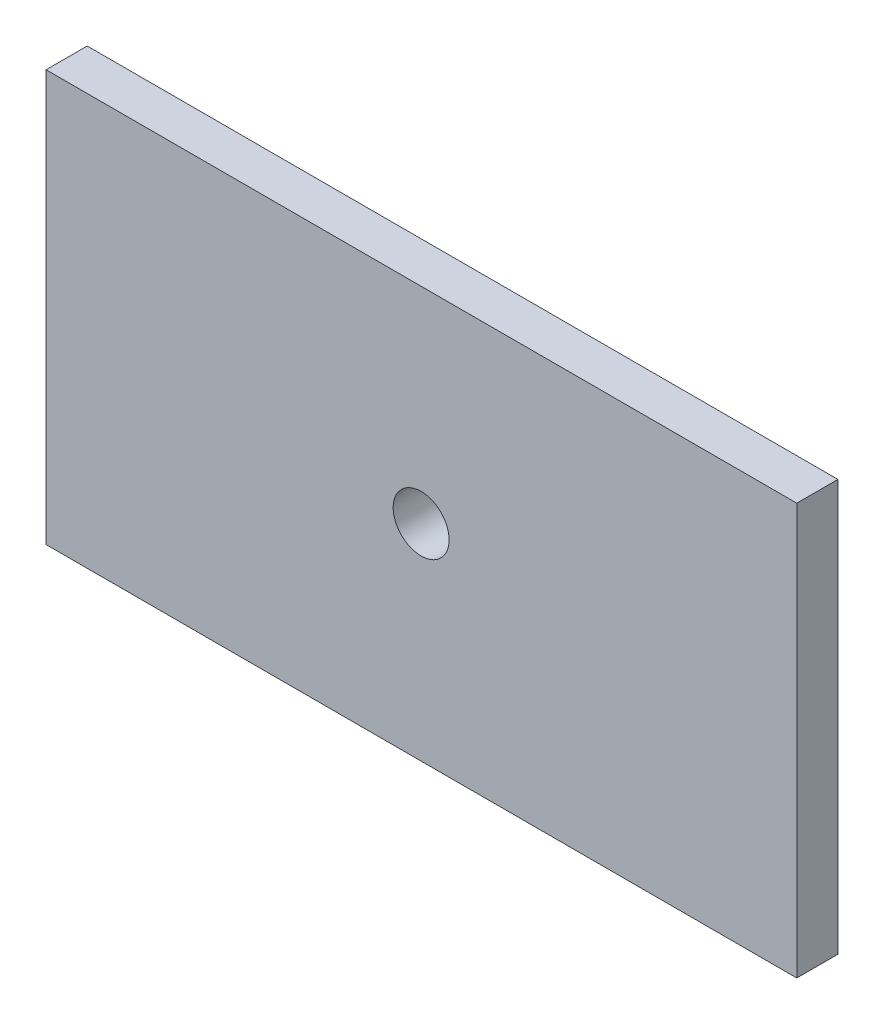
ISO-10303-21;
HEADER;
FILE_DESCRIPTION(('STEP AP214'),'2;1');
FILE_NAME('part.step','',(''),(''),'','','');
FILE_SCHEMA(('AUTOMOTIVE_DESIGN { 1 0 10303 214 1 1 1 1 }'));
ENDSEC;
DATA;
#1=APPLICATION_CONTEXT('core data for automotive mechanical design processes');
#2=APPLICATION_PROTOCOL_DEFINITION('international standard','automotive_design',2000,#1);
#3=PRODUCT_CONTEXT('',#1,'mechanical');
#4=PRODUCT('Part','Part','',(#3));
#5=PRODUCT_RELATED_PRODUCT_CATEGORY('part','',(#4));
#6=PRODUCT_DEFINITION_FORMATION('','',#4);
#7=PRODUCT_DEFINITION_CONTEXT('part definition',#1,'design');
#8=PRODUCT_DEFINITION('design','',#6,#7);
#9=PRODUCT_DEFINITION_SHAPE('','',#8);
#10=(LENGTH_UNIT() NAMED_UNIT(*) SI_UNIT(.MILLI.,.METRE.));
#11=(NAMED_UNIT(*) PLANE_ANGLE_UNIT() SI_UNIT($,.RADIAN.));
#12=(NAMED_UNIT(*) SI_UNIT($,.STERADIAN.) SOLID_ANGLE_UNIT());
#13=UNCERTAINTY_MEASURE_WITH_UNIT(LENGTH_MEASURE(1.E-05),#10,'distance_accuracy_value','');
#14=(GEOMETRIC_REPRESENTATION_CONTEXT(3) GLOBAL_UNCERTAINTY_ASSIGNED_CONTEXT((#13)) GLOBAL_UNIT_ASSIGNED_CONTEXT((#10,
#11,#12)) REPRESENTATION_CONTEXT('',''));
#15=CARTESIAN_POINT('',(0.,0.,0.));
#16=DIRECTION('',(0.,0.,1.));
#17=DIRECTION('',(1.,0.,0.));
#18=AXIS2_PLACEMENT_3D('',#15,#16,#17);
#19=CARTESIAN_POINT('',(115.91798,63.5,0.));
#20=DIRECTION('',(0.,0.,-1.));
#21=DIRECTION('',(0.,1.,0.));
#22=AXIS2_PLACEMENT_3D('',#19,#20,#21);
#23=PLANE('',#22);
#24=CARTESIAN_POINT('',(57.9119999999999,31.75,0.));
#25=DIRECTION('',(0.,0.,1.));
#26=DIRECTION('',(1.,0.,0.));
#27=AXIS2_PLACEMENT_3D('',#24,#25,#26);
#28=CIRCLE('',#27,4.318);
#29=CARTESIAN_POINT('',(62.2299999999999,31.75,0.));
#30=VERTEX_POINT('',#29);
#31=EDGE_CURVE('E111',#30,#30,#28,.T.);
#32=ORIENTED_EDGE('',*,*,#31,.F.);
#33=EDGE_LOOP('',(#32));
#34=FACE_BOUND('',#33,.T.);
#35=DIRECTION('',(0.,-1.,0.));
#36=VECTOR('',#35,1.);
#37=CARTESIAN_POINT('',(-1.38777878078145E-13,63.5,0.));
#38=LINE('',#37,#36);
#39=CARTESIAN_POINT('',(-1.38777878078145E-13,63.5,0.));
#40=VERTEX_POINT('',#39);
#41=CARTESIAN_POINT('',(0.,0.,0.));
#42=VERTEX_POINT('',#41);
#43=EDGE_CURVE('E98',#40,#42,#38,.T.);
#44=ORIENTED_EDGE('',*,*,#43,.T.);
#45=DIRECTION('',(-1.,0.,0.));
#46=VECTOR('',#45,1.);
#47=CARTESIAN_POINT('',(115.91798,0.,0.));
#48=LINE('',#47,#46);
#49=CARTESIAN_POINT('',(115.91798,0.,0.));
#50=VERTEX_POINT('',#49);
#51=EDGE_CURVE('E11',#50,#42,#48,.T.);
#52=ORIENTED_EDGE('',*,*,#51,.F.);
#53=DIRECTION('',(0.,-1.,0.));
#54=VECTOR('',#53,1.);
#55=CARTESIAN_POINT('',(115.91798,63.5,0.));
#56=LINE('',#55,#54);
#57=CARTESIAN_POINT('',(115.91798,63.5,0.));
#58=VERTEX_POINT('',#57);
#59=EDGE_CURVE('E85',#58,#50,#56,.T.);
#60=ORIENTED_EDGE('',*,*,#59,.F.);
#61=DIRECTION('',(-1.,0.,0.));
#62=VECTOR('',#61,1.);
#63=CARTESIAN_POINT('',(115.91798,63.5,0.));
#64=LINE('',#63,#62);
#65=EDGE_CURVE('E94',#58,#40,#64,.T.);
#66=ORIENTED_EDGE('',*,*,#65,.T.);
#67=EDGE_LOOP('',(#44,#52,#60,#66));
#68=FACE_BOUND('',#67,.T.);
#69=ADVANCED_FACE('F33',(#34,#68),#23,.F.);
#70=CARTESIAN_POINT('',(115.91798,0.,0.));
#71=DIRECTION('',(0.,1.,0.));
#72=DIRECTION('',(0.,0.,1.));
#73=AXIS2_PLACEMENT_3D('',#70,#71,#72);
#74=PLANE('',#73);
#75=DIRECTION('',(0.,0.,-1.));
#76=VECTOR('',#75,1.);
#77=CARTESIAN_POINT('',(0.,0.,0.));
#78=LINE('',#77,#76);
#79=CARTESIAN_POINT('',(0.,0.,-6.34999999999997));
#80=VERTEX_POINT('',#79);
#81=EDGE_CURVE('E89',#42,#80,#78,.T.);
#82=ORIENTED_EDGE('',*,*,#81,.T.);
#83=DIRECTION('',(-1.,0.,0.));
#84=VECTOR('',#83,1.);
#85=CARTESIAN_POINT('',(115.91798,0.,-6.35000000000004));
#86=LINE('',#85,#84);
#87=CARTESIAN_POINT('',(115.91798,0.,-6.35000000000004));
#88=VERTEX_POINT('',#87);
#89=EDGE_CURVE('E42',#88,#80,#86,.T.);
#90=ORIENTED_EDGE('',*,*,#89,.F.);
#91=DIRECTION('',(0.,0.,-1.));
#92=VECTOR('',#91,1.);
#93=CARTESIAN_POINT('',(115.91798,0.,0.));
#94=LINE('',#93,#92);
#95=EDGE_CURVE('E80',#50,#88,#94,.T.);
#96=ORIENTED_EDGE('',*,*,#95,.F.);
#97=ORIENTED_EDGE('',*,*,#51,.T.);
#98=EDGE_LOOP('',(#82,#90,#96,#97));
#99=FACE_BOUND('',#98,.T.);
#100=ADVANCED_FACE('F88',(#99),#74,.F.);
#101=CARTESIAN_POINT('',(115.91798,63.5,-6.35000000000006));
#102=DIRECTION('',(0.,0.,1.));
#103=DIRECTION('',(0.,-1.,0.));
#104=AXIS2_PLACEMENT_3D('',#101,#102,#103);
#105=PLANE('',#104);
#106=CARTESIAN_POINT('',(57.9119999999999,31.75,-6.35000000000004));
#107=DIRECTION('',(0.,0.,1.));
#108=DIRECTION('',(0.,-1.,0.));
#109=AXIS2_PLACEMENT_3D('',#106,#107,#108);
#110=CIRCLE('',#109,4.318);
#111=CARTESIAN_POINT('',(57.9119999999999,27.432,-6.35000000000004));
#112=VERTEX_POINT('',#111);
#113=EDGE_CURVE('E36',#112,#112,#110,.T.);
#114=ORIENTED_EDGE('',*,*,#113,.T.);
#115=EDGE_LOOP('',(#114));
#116=FACE_BOUND('',#115,.T.);
#117=DIRECTION('',(0.,1.,0.));
#118=VECTOR('',#117,1.);
#119=CARTESIAN_POINT('',(-1.38777878078145E-13,63.5,-6.35000000000004));
#120=LINE('',#119,#118);
#121=CARTESIAN_POINT('',(-1.38777878078145E-13,63.5,-6.35000000000004));
#122=VERTEX_POINT('',#121);
#123=EDGE_CURVE('E67',#80,#122,#120,.T.);
#124=ORIENTED_EDGE('',*,*,#123,.T.);
#125=DIRECTION('',(-1.,0.,0.));
#126=VECTOR('',#125,1.);
#127=CARTESIAN_POINT('',(115.91798,63.5,-6.35000000000006));
#128=LINE('',#127,#126);
#129=CARTESIAN_POINT('',(115.91798,63.5,-6.35000000000006));
#130=VERTEX_POINT('',#129);
#131=EDGE_CURVE('E90',#130,#122,#128,.T.);
#132=ORIENTED_EDGE('',*,*,#131,.F.);
#133=DIRECTION('',(0.,1.,0.));
#134=VECTOR('',#133,1.);
#135=CARTESIAN_POINT('',(115.91798,63.5,-6.35000000000006));
#136=LINE('',#135,#134);
#137=EDGE_CURVE('E83',#88,#130,#136,.T.);
#138=ORIENTED_EDGE('',*,*,#137,.F.);
#139=ORIENTED_EDGE('',*,*,#89,.T.);
#140=EDGE_LOOP('',(#124,#132,#138,#139));
#141=FACE_BOUND('',#140,.T.);
#142=ADVANCED_FACE('F92',(#116,#141),#105,.F.);
#143=CARTESIAN_POINT('',(115.91798,63.5,-6.35000000000006));
#144=DIRECTION('',(0.,-1.,0.));
#145=DIRECTION('',(0.,0.,-1.));
#146=AXIS2_PLACEMENT_3D('',#143,#144,#145);
#147=PLANE('',#146);
#148=DIRECTION('',(0.,0.,1.));
#149=VECTOR('',#148,1.);
#150=CARTESIAN_POINT('',(-1.38777878078145E-13,63.5,-6.35000000000004));
#151=LINE('',#150,#149);
#152=EDGE_CURVE('E73',#122,#40,#151,.T.);
#153=ORIENTED_EDGE('',*,*,#152,.T.);
#154=ORIENTED_EDGE('',*,*,#65,.F.);
#155=DIRECTION('',(0.,0.,1.));
#156=VECTOR('',#155,1.);
#157=CARTESIAN_POINT('',(115.91798,63.5,-6.35000000000006));
#158=LINE('',#157,#156);
#159=EDGE_CURVE('E50',#130,#58,#158,.T.);
#160=ORIENTED_EDGE('',*,*,#159,.F.);
#161=ORIENTED_EDGE('',*,*,#131,.T.);
#162=EDGE_LOOP('',(#153,#154,#160,#161));
#163=FACE_BOUND('',#162,.T.);
#164=ADVANCED_FACE('F105',(#163),#147,.F.);
#165=CARTESIAN_POINT('',(115.91798,0.,0.));
#166=DIRECTION('',(1.,0.,0.));
#167=DIRECTION('',(0.,0.,-1.));
#168=AXIS2_PLACEMENT_3D('',#165,#166,#167);
#169=PLANE('',#168);
#170=ORIENTED_EDGE('',*,*,#59,.T.);
#171=ORIENTED_EDGE('',*,*,#95,.T.);
#172=ORIENTED_EDGE('',*,*,#137,.T.);
#173=ORIENTED_EDGE('',*,*,#159,.T.);
#174=EDGE_LOOP('',(#170,#171,#172,#173));
#175=FACE_BOUND('',#174,.T.);
#176=ADVANCED_FACE('F81',(#175),#169,.T.);
#177=CARTESIAN_POINT('',(0.,0.,0.));
#178=DIRECTION('',(1.,0.,0.));
#179=DIRECTION('',(0.,0.,-1.));
#180=AXIS2_PLACEMENT_3D('',#177,#178,#179);
#181=PLANE('',#180);
#182=ORIENTED_EDGE('',*,*,#43,.F.);
#183=ORIENTED_EDGE('',*,*,#152,.F.);
#184=ORIENTED_EDGE('',*,*,#123,.F.);
#185=ORIENTED_EDGE('',*,*,#81,.F.);
#186=EDGE_LOOP('',(#182,#183,#184,#185));
#187=FACE_BOUND('',#186,.T.);
#188=ADVANCED_FACE('F108',(#187),#181,.F.);
#189=CARTESIAN_POINT('',(57.9119999999999,31.75,-12.7));
#190=DIRECTION('',(0.,0.,1.));
#191=DIRECTION('',(1.,0.,0.));
#192=AXIS2_PLACEMENT_3D('',#189,#190,#191);
#193=CYLINDRICAL_SURFACE('',#192,4.318);
#194=ORIENTED_EDGE('',*,*,#31,.T.);
#195=EDGE_LOOP('',(#194));
#196=FACE_BOUND('',#195,.T.);
#197=ORIENTED_EDGE('',*,*,#113,.F.);
#198=EDGE_LOOP('',(#197));
#199=FACE_BOUND('',#198,.T.);
#200=ADVANCED_FACE('F119',(#196,#199),#193,.F.);
#201=CLOSED_SHELL('',(#69,#100,#142,#164,#176,#188,#200));
#202=MANIFOLD_SOLID_BREP('B2',#201);
#203=ADVANCED_BREP_SHAPE_REPRESENTATION('',(#18,#202),#14);
#204=SHAPE_DEFINITION_REPRESENTATION(#9,#203);
ENDSEC;
END-ISO-10303-21;
